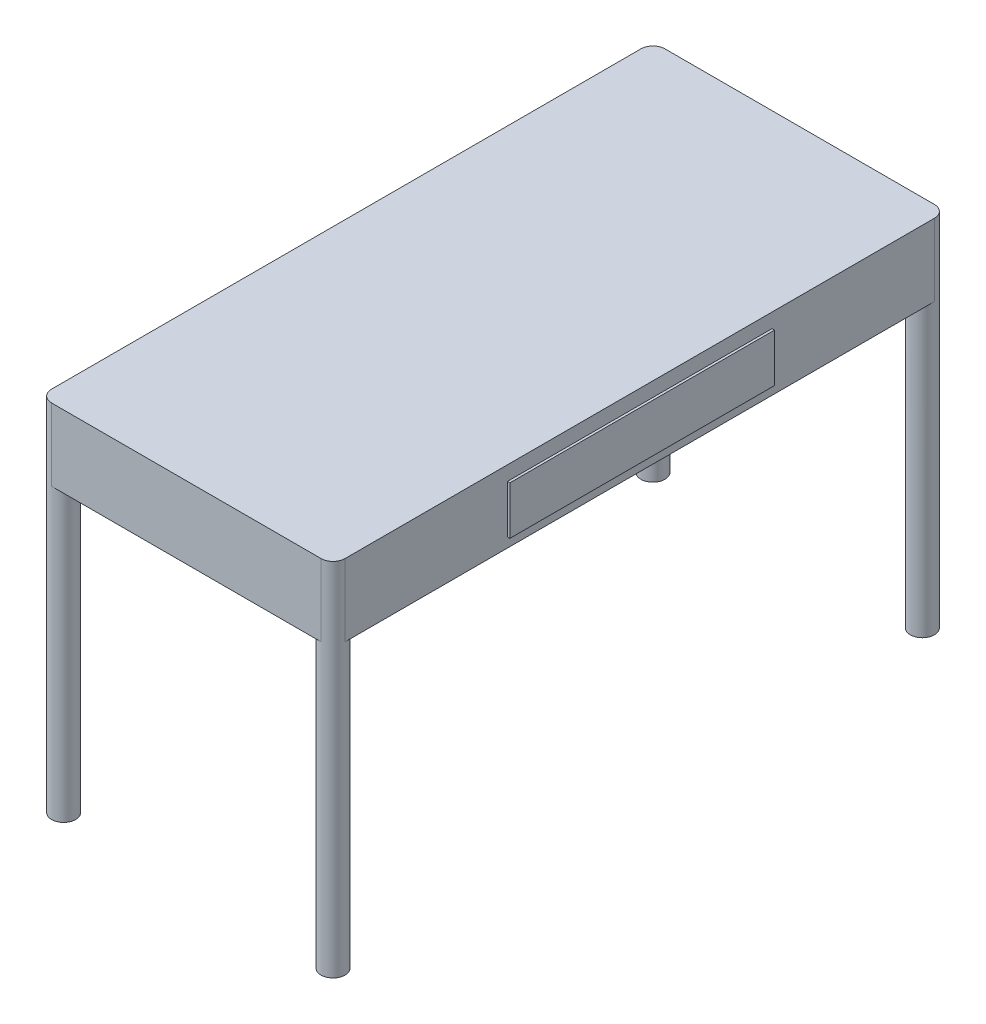
ISO-10303-21;
HEADER;
FILE_DESCRIPTION(('STEP AP214'),'2;1');
FILE_NAME('part.step','',(''),(''),'','','');
FILE_SCHEMA(('AUTOMOTIVE_DESIGN { 1 0 10303 214 1 1 1 1 }'));
ENDSEC;
DATA;
#1=APPLICATION_CONTEXT('core data for automotive mechanical design processes');
#2=APPLICATION_PROTOCOL_DEFINITION('international standard','automotive_design',2000,#1);
#3=PRODUCT_CONTEXT('',#1,'mechanical');
#4=PRODUCT('Part','Part','',(#3));
#5=PRODUCT_RELATED_PRODUCT_CATEGORY('part','',(#4));
#6=PRODUCT_DEFINITION_FORMATION('','',#4);
#7=PRODUCT_DEFINITION_CONTEXT('part definition',#1,'design');
#8=PRODUCT_DEFINITION('design','',#6,#7);
#9=PRODUCT_DEFINITION_SHAPE('','',#8);
#10=(LENGTH_UNIT() NAMED_UNIT(*) SI_UNIT(.MILLI.,.METRE.));
#11=(NAMED_UNIT(*) PLANE_ANGLE_UNIT() SI_UNIT($,.RADIAN.));
#12=(NAMED_UNIT(*) SI_UNIT($,.STERADIAN.) SOLID_ANGLE_UNIT());
#13=UNCERTAINTY_MEASURE_WITH_UNIT(LENGTH_MEASURE(1.E-05),#10,'distance_accuracy_value','');
#14=(GEOMETRIC_REPRESENTATION_CONTEXT(3) GLOBAL_UNCERTAINTY_ASSIGNED_CONTEXT((#13)) GLOBAL_UNIT_ASSIGNED_CONTEXT((#10,
#11,#12)) REPRESENTATION_CONTEXT('',''));
#15=CARTESIAN_POINT('',(0.,0.,0.));
#16=DIRECTION('',(0.,0.,1.));
#17=DIRECTION('',(1.,0.,0.));
#18=AXIS2_PLACEMENT_3D('',#15,#16,#17);
#19=CARTESIAN_POINT('',(305.,-150.,637.5));
#20=DIRECTION('',(1.,0.,0.));
#21=DIRECTION('',(0.,0.,-1.));
#22=AXIS2_PLACEMENT_3D('',#19,#20,#21);
#23=PLANE('',#22);
#24=DIRECTION('',(0.,0.,-1.));
#25=VECTOR('',#24,1.);
#26=CARTESIAN_POINT('',(305.,-150.,637.5));
#27=LINE('',#26,#25);
#28=CARTESIAN_POINT('',(305.,-150.,612.5));
#29=VERTEX_POINT('',#28);
#30=CARTESIAN_POINT('',(305.,-150.,-612.5));
#31=VERTEX_POINT('',#30);
#32=EDGE_CURVE('E175',#29,#31,#27,.T.);
#33=ORIENTED_EDGE('',*,*,#32,.T.);
#34=DIRECTION('',(0.,1.,0.));
#35=VECTOR('',#34,1.);
#36=CARTESIAN_POINT('',(305.,-150.,-612.5));
#37=LINE('',#36,#35);
#38=CARTESIAN_POINT('',(305.,0.,-612.5));
#39=VERTEX_POINT('',#38);
#40=EDGE_CURVE('E218',#31,#39,#37,.T.);
#41=ORIENTED_EDGE('',*,*,#40,.T.);
#42=DIRECTION('',(0.,0.,-1.));
#43=VECTOR('',#42,1.);
#44=CARTESIAN_POINT('',(305.,0.,637.5));
#45=LINE('',#44,#43);
#46=CARTESIAN_POINT('',(305.,0.,612.5));
#47=VERTEX_POINT('',#46);
#48=EDGE_CURVE('E174',#47,#39,#45,.T.);
#49=ORIENTED_EDGE('',*,*,#48,.F.);
#50=DIRECTION('',(0.,1.,0.));
#51=VECTOR('',#50,1.);
#52=CARTESIAN_POINT('',(305.,-150.,612.5));
#53=LINE('',#52,#51);
#54=EDGE_CURVE('E215',#47,#29,#53,.F.);
#55=ORIENTED_EDGE('',*,*,#54,.T.);
#56=EDGE_LOOP('',(#33,#41,#49,#55));
#57=FACE_BOUND('',#56,.T.);
#58=DIRECTION('',(0.,0.,1.));
#59=VECTOR('',#58,1.);
#60=CARTESIAN_POINT('',(305.,-30.,275.));
#61=LINE('',#60,#59);
#62=CARTESIAN_POINT('',(305.,-30.,-275.));
#63=VERTEX_POINT('',#62);
#64=CARTESIAN_POINT('',(305.,-30.,275.));
#65=VERTEX_POINT('',#64);
#66=EDGE_CURVE('E412',#63,#65,#61,.T.);
#67=ORIENTED_EDGE('',*,*,#66,.F.);
#68=DIRECTION('',(0.,1.,0.));
#69=VECTOR('',#68,1.);
#70=CARTESIAN_POINT('',(305.,-130.,-275.));
#71=LINE('',#70,#69);
#72=CARTESIAN_POINT('',(305.,-130.,-275.));
#73=VERTEX_POINT('',#72);
#74=EDGE_CURVE('E147',#73,#63,#71,.T.);
#75=ORIENTED_EDGE('',*,*,#74,.F.);
#76=DIRECTION('',(0.,0.,-1.));
#77=VECTOR('',#76,1.);
#78=CARTESIAN_POINT('',(305.,-130.,275.));
#79=LINE('',#78,#77);
#80=CARTESIAN_POINT('',(305.,-130.,275.));
#81=VERTEX_POINT('',#80);
#82=EDGE_CURVE('E143',#81,#73,#79,.T.);
#83=ORIENTED_EDGE('',*,*,#82,.F.);
#84=DIRECTION('',(0.,-1.,0.));
#85=VECTOR('',#84,1.);
#86=CARTESIAN_POINT('',(305.,-130.,275.));
#87=LINE('',#86,#85);
#88=EDGE_CURVE('E409',#65,#81,#87,.T.);
#89=ORIENTED_EDGE('',*,*,#88,.F.);
#90=EDGE_LOOP('',(#67,#75,#83,#89));
#91=FACE_BOUND('',#90,.T.);
#92=ADVANCED_FACE('F34',(#57,#91),#23,.T.);
#93=CARTESIAN_POINT('',(0.,-150.,0.));
#94=DIRECTION('',(0.,-1.,0.));
#95=DIRECTION('',(0.,0.,-1.));
#96=AXIS2_PLACEMENT_3D('',#93,#94,#95);
#97=PLANE('',#96);
#98=CARTESIAN_POINT('',(-280.,-150.,-612.5));
#99=DIRECTION('',(0.,-1.,0.));
#100=DIRECTION('',(0.,0.,-1.));
#101=AXIS2_PLACEMENT_3D('',#98,#99,#100);
#102=CIRCLE('',#101,25.);
#103=CARTESIAN_POINT('',(-280.,-150.,-637.5));
#104=VERTEX_POINT('',#103);
#105=CARTESIAN_POINT('',(-305.,-150.,-612.5));
#106=VERTEX_POINT('',#105);
#107=EDGE_CURVE('E152',#104,#106,#102,.T.);
#108=ORIENTED_EDGE('',*,*,#107,.F.);
#109=DIRECTION('',(-1.,0.,0.));
#110=VECTOR('',#109,1.);
#111=CARTESIAN_POINT('',(-305.,-150.,-637.5));
#112=LINE('',#111,#110);
#113=CARTESIAN_POINT('',(280.,-150.,-637.5));
#114=VERTEX_POINT('',#113);
#115=EDGE_CURVE('E178',#114,#104,#112,.T.);
#116=ORIENTED_EDGE('',*,*,#115,.F.);
#117=CARTESIAN_POINT('',(280.,-150.,-612.5));
#118=DIRECTION('',(0.,-1.,0.));
#119=DIRECTION('',(0.,0.,-1.));
#120=AXIS2_PLACEMENT_3D('',#117,#118,#119);
#121=CIRCLE('',#120,25.);
#122=EDGE_CURVE('E162',#114,#31,#121,.F.);
#123=ORIENTED_EDGE('',*,*,#122,.T.);
#124=ORIENTED_EDGE('',*,*,#32,.F.);
#125=CARTESIAN_POINT('',(280.,-150.,612.5));
#126=DIRECTION('',(0.,-1.,0.));
#127=DIRECTION('',(0.,0.,-1.));
#128=AXIS2_PLACEMENT_3D('',#125,#126,#127);
#129=CIRCLE('',#128,25.);
#130=CARTESIAN_POINT('',(280.,-150.,637.5));
#131=VERTEX_POINT('',#130);
#132=EDGE_CURVE('E57',#131,#29,#129,.T.);
#133=ORIENTED_EDGE('',*,*,#132,.F.);
#134=DIRECTION('',(1.,0.,0.));
#135=VECTOR('',#134,1.);
#136=CARTESIAN_POINT('',(-305.,-150.,637.5));
#137=LINE('',#136,#135);
#138=CARTESIAN_POINT('',(-280.,-150.,637.5));
#139=VERTEX_POINT('',#138);
#140=EDGE_CURVE('E185',#139,#131,#137,.T.);
#141=ORIENTED_EDGE('',*,*,#140,.F.);
#142=CARTESIAN_POINT('',(-280.,-150.,612.5));
#143=DIRECTION('',(0.,-1.,0.));
#144=DIRECTION('',(0.,0.,-1.));
#145=AXIS2_PLACEMENT_3D('',#142,#143,#144);
#146=CIRCLE('',#145,25.);
#147=CARTESIAN_POINT('',(-305.,-150.,612.5));
#148=VERTEX_POINT('',#147);
#149=EDGE_CURVE('E168',#139,#148,#146,.F.);
#150=ORIENTED_EDGE('',*,*,#149,.T.);
#151=DIRECTION('',(0.,0.,1.));
#152=VECTOR('',#151,1.);
#153=CARTESIAN_POINT('',(-305.,-150.,637.5));
#154=LINE('',#153,#152);
#155=EDGE_CURVE('E182',#106,#148,#154,.T.);
#156=ORIENTED_EDGE('',*,*,#155,.F.);
#157=EDGE_LOOP('',(#108,#116,#123,#124,#133,#141,#150,#156));
#158=FACE_BOUND('',#157,.T.);
#159=ADVANCED_FACE('F240',(#158),#97,.T.);
#160=CARTESIAN_POINT('',(-305.,-150.,637.5));
#161=DIRECTION('',(0.,0.,1.));
#162=DIRECTION('',(1.,0.,0.));
#163=AXIS2_PLACEMENT_3D('',#160,#161,#162);
#164=PLANE('',#163);
#165=DIRECTION('',(1.,0.,0.));
#166=VECTOR('',#165,1.);
#167=CARTESIAN_POINT('',(-305.,0.,637.5));
#168=LINE('',#167,#166);
#169=CARTESIAN_POINT('',(-280.,0.,637.5));
#170=VERTEX_POINT('',#169);
#171=CARTESIAN_POINT('',(280.,0.,637.5));
#172=VERTEX_POINT('',#171);
#173=EDGE_CURVE('E179',#170,#172,#168,.T.);
#174=ORIENTED_EDGE('',*,*,#173,.F.);
#175=DIRECTION('',(0.,1.,0.));
#176=VECTOR('',#175,1.);
#177=CARTESIAN_POINT('',(-280.,-150.,637.5));
#178=LINE('',#177,#176);
#179=EDGE_CURVE('E11',#170,#139,#178,.F.);
#180=ORIENTED_EDGE('',*,*,#179,.T.);
#181=ORIENTED_EDGE('',*,*,#140,.T.);
#182=DIRECTION('',(0.,1.,0.));
#183=VECTOR('',#182,1.);
#184=CARTESIAN_POINT('',(280.,-150.,637.5));
#185=LINE('',#184,#183);
#186=EDGE_CURVE('E42',#131,#172,#185,.T.);
#187=ORIENTED_EDGE('',*,*,#186,.T.);
#188=EDGE_LOOP('',(#174,#180,#181,#187));
#189=FACE_BOUND('',#188,.T.);
#190=ADVANCED_FACE('F224',(#189),#164,.T.);
#191=CARTESIAN_POINT('',(-305.,-150.,637.5));
#192=DIRECTION('',(-1.,0.,0.));
#193=DIRECTION('',(0.,0.,1.));
#194=AXIS2_PLACEMENT_3D('',#191,#192,#193);
#195=PLANE('',#194);
#196=DIRECTION('',(0.,0.,1.));
#197=VECTOR('',#196,1.);
#198=CARTESIAN_POINT('',(-305.,0.,637.5));
#199=LINE('',#198,#197);
#200=CARTESIAN_POINT('',(-305.,0.,-612.5));
#201=VERTEX_POINT('',#200);
#202=CARTESIAN_POINT('',(-305.,0.,612.5));
#203=VERTEX_POINT('',#202);
#204=EDGE_CURVE('E193',#201,#203,#199,.T.);
#205=ORIENTED_EDGE('',*,*,#204,.F.);
#206=DIRECTION('',(0.,1.,0.));
#207=VECTOR('',#206,1.);
#208=CARTESIAN_POINT('',(-305.,-150.,-612.5));
#209=LINE('',#208,#207);
#210=EDGE_CURVE('E213',#201,#106,#209,.F.);
#211=ORIENTED_EDGE('',*,*,#210,.T.);
#212=ORIENTED_EDGE('',*,*,#155,.T.);
#213=DIRECTION('',(0.,1.,0.));
#214=VECTOR('',#213,1.);
#215=CARTESIAN_POINT('',(-305.,-150.,612.5));
#216=LINE('',#215,#214);
#217=EDGE_CURVE('E210',#148,#203,#216,.T.);
#218=ORIENTED_EDGE('',*,*,#217,.T.);
#219=EDGE_LOOP('',(#205,#211,#212,#218));
#220=FACE_BOUND('',#219,.T.);
#221=ADVANCED_FACE('F236',(#220),#195,.T.);
#222=CARTESIAN_POINT('',(-305.,-150.,-637.5));
#223=DIRECTION('',(0.,0.,-1.));
#224=DIRECTION('',(-1.,0.,0.));
#225=AXIS2_PLACEMENT_3D('',#222,#223,#224);
#226=PLANE('',#225);
#227=ORIENTED_EDGE('',*,*,#115,.T.);
#228=DIRECTION('',(0.,1.,0.));
#229=VECTOR('',#228,1.);
#230=CARTESIAN_POINT('',(-280.,-150.,-637.5));
#231=LINE('',#230,#229);
#232=CARTESIAN_POINT('',(-280.,0.,-637.5));
#233=VERTEX_POINT('',#232);
#234=EDGE_CURVE('E199',#104,#233,#231,.T.);
#235=ORIENTED_EDGE('',*,*,#234,.T.);
#236=DIRECTION('',(-1.,0.,0.));
#237=VECTOR('',#236,1.);
#238=CARTESIAN_POINT('',(-305.,0.,-637.5));
#239=LINE('',#238,#237);
#240=CARTESIAN_POINT('',(280.,0.,-637.5));
#241=VERTEX_POINT('',#240);
#242=EDGE_CURVE('E190',#241,#233,#239,.T.);
#243=ORIENTED_EDGE('',*,*,#242,.F.);
#244=DIRECTION('',(0.,1.,0.));
#245=VECTOR('',#244,1.);
#246=CARTESIAN_POINT('',(280.,-150.,-637.5));
#247=LINE('',#246,#245);
#248=EDGE_CURVE('E187',#241,#114,#247,.F.);
#249=ORIENTED_EDGE('',*,*,#248,.T.);
#250=EDGE_LOOP('',(#227,#235,#243,#249));
#251=FACE_BOUND('',#250,.T.);
#252=ADVANCED_FACE('F247',(#251),#226,.T.);
#253=CARTESIAN_POINT('',(0.,0.,0.));
#254=DIRECTION('',(0.,-1.,0.));
#255=DIRECTION('',(0.,0.,-1.));
#256=AXIS2_PLACEMENT_3D('',#253,#254,#255);
#257=PLANE('',#256);
#258=ORIENTED_EDGE('',*,*,#242,.T.);
#259=CARTESIAN_POINT('',(-280.,0.,-612.5));
#260=DIRECTION('',(0.,-1.,0.));
#261=DIRECTION('',(0.,0.,-1.));
#262=AXIS2_PLACEMENT_3D('',#259,#260,#261);
#263=CIRCLE('',#262,25.);
#264=EDGE_CURVE('E208',#233,#201,#263,.F.);
#265=ORIENTED_EDGE('',*,*,#264,.T.);
#266=ORIENTED_EDGE('',*,*,#204,.T.);
#267=CARTESIAN_POINT('',(-280.,0.,612.5));
#268=DIRECTION('',(0.,-1.,0.));
#269=DIRECTION('',(0.,0.,-1.));
#270=AXIS2_PLACEMENT_3D('',#267,#268,#269);
#271=CIRCLE('',#270,25.);
#272=EDGE_CURVE('E204',#203,#170,#271,.F.);
#273=ORIENTED_EDGE('',*,*,#272,.T.);
#274=ORIENTED_EDGE('',*,*,#173,.T.);
#275=CARTESIAN_POINT('',(280.,0.,612.5));
#276=DIRECTION('',(0.,-1.,0.));
#277=DIRECTION('',(0.,0.,-1.));
#278=AXIS2_PLACEMENT_3D('',#275,#276,#277);
#279=CIRCLE('',#278,25.);
#280=EDGE_CURVE('E202',#172,#47,#279,.F.);
#281=ORIENTED_EDGE('',*,*,#280,.T.);
#282=ORIENTED_EDGE('',*,*,#48,.T.);
#283=CARTESIAN_POINT('',(280.,0.,-612.5));
#284=DIRECTION('',(0.,-1.,0.));
#285=DIRECTION('',(0.,0.,-1.));
#286=AXIS2_PLACEMENT_3D('',#283,#284,#285);
#287=CIRCLE('',#286,25.);
#288=EDGE_CURVE('E206',#39,#241,#287,.F.);
#289=ORIENTED_EDGE('',*,*,#288,.T.);
#290=EDGE_LOOP('',(#258,#265,#266,#273,#274,#281,#282,#289));
#291=FACE_BOUND('',#290,.T.);
#292=ADVANCED_FACE('F228',(#291),#257,.F.);
#293=CARTESIAN_POINT('',(-280.,-150.,-612.5));
#294=DIRECTION('',(0.,1.,0.));
#295=DIRECTION('',(0.,0.,1.));
#296=AXIS2_PLACEMENT_3D('',#293,#294,#295);
#297=CYLINDRICAL_SURFACE('',#296,25.);
#298=ORIENTED_EDGE('',*,*,#234,.F.);
#299=ORIENTED_EDGE('',*,*,#107,.T.);
#300=ORIENTED_EDGE('',*,*,#210,.F.);
#301=ORIENTED_EDGE('',*,*,#264,.F.);
#302=EDGE_LOOP('',(#298,#299,#300,#301));
#303=FACE_BOUND('',#302,.T.);
#304=CARTESIAN_POINT('',(-280.,-750.,-612.5));
#305=DIRECTION('',(0.,1.,0.));
#306=DIRECTION('',(0.,0.,-1.));
#307=AXIS2_PLACEMENT_3D('',#304,#305,#306);
#308=CIRCLE('',#307,25.);
#309=CARTESIAN_POINT('',(-280.,-750.,-637.5));
#310=VERTEX_POINT('',#309);
#311=EDGE_CURVE('E149',#310,#310,#308,.T.);
#312=ORIENTED_EDGE('',*,*,#311,.T.);
#313=EDGE_LOOP('',(#312));
#314=FACE_BOUND('',#313,.T.);
#315=ADVANCED_FACE('F243',(#303,#314),#297,.T.);
#316=CARTESIAN_POINT('',(280.,-150.,-612.5));
#317=DIRECTION('',(0.,1.,0.));
#318=DIRECTION('',(0.,0.,1.));
#319=AXIS2_PLACEMENT_3D('',#316,#317,#318);
#320=CYLINDRICAL_SURFACE('',#319,25.);
#321=ORIENTED_EDGE('',*,*,#40,.F.);
#322=ORIENTED_EDGE('',*,*,#122,.F.);
#323=ORIENTED_EDGE('',*,*,#248,.F.);
#324=ORIENTED_EDGE('',*,*,#288,.F.);
#325=EDGE_LOOP('',(#321,#322,#323,#324));
#326=FACE_BOUND('',#325,.T.);
#327=CARTESIAN_POINT('',(280.,-750.,-612.5));
#328=DIRECTION('',(0.,-1.,0.));
#329=DIRECTION('',(0.,0.,-1.));
#330=AXIS2_PLACEMENT_3D('',#327,#328,#329);
#331=CIRCLE('',#330,25.);
#332=CARTESIAN_POINT('',(280.,-750.,-637.5));
#333=VERTEX_POINT('',#332);
#334=EDGE_CURVE('E159',#333,#333,#331,.T.);
#335=ORIENTED_EDGE('',*,*,#334,.F.);
#336=EDGE_LOOP('',(#335));
#337=FACE_BOUND('',#336,.T.);
#338=ADVANCED_FACE('F251',(#326,#337),#320,.T.);
#339=CARTESIAN_POINT('',(-280.,-150.,612.5));
#340=DIRECTION('',(0.,1.,0.));
#341=DIRECTION('',(0.,0.,1.));
#342=AXIS2_PLACEMENT_3D('',#339,#340,#341);
#343=CYLINDRICAL_SURFACE('',#342,25.);
#344=ORIENTED_EDGE('',*,*,#217,.F.);
#345=ORIENTED_EDGE('',*,*,#149,.F.);
#346=ORIENTED_EDGE('',*,*,#179,.F.);
#347=ORIENTED_EDGE('',*,*,#272,.F.);
#348=EDGE_LOOP('',(#344,#345,#346,#347));
#349=FACE_BOUND('',#348,.T.);
#350=CARTESIAN_POINT('',(-280.,-750.,612.5));
#351=DIRECTION('',(0.,-1.,0.));
#352=DIRECTION('',(0.,0.,1.));
#353=AXIS2_PLACEMENT_3D('',#350,#351,#352);
#354=CIRCLE('',#353,25.);
#355=CARTESIAN_POINT('',(-280.,-750.,637.5));
#356=VERTEX_POINT('',#355);
#357=EDGE_CURVE('E165',#356,#356,#354,.T.);
#358=ORIENTED_EDGE('',*,*,#357,.F.);
#359=EDGE_LOOP('',(#358));
#360=FACE_BOUND('',#359,.T.);
#361=ADVANCED_FACE('F233',(#349,#360),#343,.T.);
#362=CARTESIAN_POINT('',(280.,-150.,612.5));
#363=DIRECTION('',(0.,1.,0.));
#364=DIRECTION('',(0.,0.,1.));
#365=AXIS2_PLACEMENT_3D('',#362,#363,#364);
#366=CYLINDRICAL_SURFACE('',#365,25.);
#367=ORIENTED_EDGE('',*,*,#186,.F.);
#368=ORIENTED_EDGE('',*,*,#132,.T.);
#369=ORIENTED_EDGE('',*,*,#54,.F.);
#370=ORIENTED_EDGE('',*,*,#280,.F.);
#371=EDGE_LOOP('',(#367,#368,#369,#370));
#372=FACE_BOUND('',#371,.T.);
#373=CARTESIAN_POINT('',(280.,-750.,612.5));
#374=DIRECTION('',(0.,1.,0.));
#375=DIRECTION('',(0.,0.,1.));
#376=AXIS2_PLACEMENT_3D('',#373,#374,#375);
#377=CIRCLE('',#376,25.);
#378=CARTESIAN_POINT('',(280.,-750.,637.5));
#379=VERTEX_POINT('',#378);
#380=EDGE_CURVE('E170',#379,#379,#377,.T.);
#381=ORIENTED_EDGE('',*,*,#380,.T.);
#382=EDGE_LOOP('',(#381));
#383=FACE_BOUND('',#382,.T.);
#384=ADVANCED_FACE('F36',(#372,#383),#366,.T.);
#385=CARTESIAN_POINT('',(280.,-750.,612.5));
#386=DIRECTION('',(0.,1.,0.));
#387=DIRECTION('',(0.,0.,1.));
#388=AXIS2_PLACEMENT_3D('',#385,#386,#387);
#389=PLANE('',#388);
#390=ORIENTED_EDGE('',*,*,#380,.F.);
#391=EDGE_LOOP('',(#390));
#392=FACE_BOUND('',#391,.T.);
#393=ADVANCED_FACE('F258',(#392),#389,.F.);
#394=CARTESIAN_POINT('',(-280.,-750.,612.5));
#395=DIRECTION('',(0.,1.,0.));
#396=DIRECTION('',(0.,0.,1.));
#397=AXIS2_PLACEMENT_3D('',#394,#395,#396);
#398=PLANE('',#397);
#399=ORIENTED_EDGE('',*,*,#357,.T.);
#400=EDGE_LOOP('',(#399));
#401=FACE_BOUND('',#400,.T.);
#402=ADVANCED_FACE('F262',(#401),#398,.F.);
#403=CARTESIAN_POINT('',(280.,-750.,-612.5));
#404=DIRECTION('',(0.,1.,0.));
#405=DIRECTION('',(0.,0.,-1.));
#406=AXIS2_PLACEMENT_3D('',#403,#404,#405);
#407=PLANE('',#406);
#408=ORIENTED_EDGE('',*,*,#334,.T.);
#409=EDGE_LOOP('',(#408));
#410=FACE_BOUND('',#409,.T.);
#411=ADVANCED_FACE('F267',(#410),#407,.F.);
#412=CARTESIAN_POINT('',(-280.,-750.,-612.5));
#413=DIRECTION('',(0.,1.,0.));
#414=DIRECTION('',(0.,0.,-1.));
#415=AXIS2_PLACEMENT_3D('',#412,#413,#414);
#416=PLANE('',#415);
#417=ORIENTED_EDGE('',*,*,#311,.F.);
#418=EDGE_LOOP('',(#417));
#419=FACE_BOUND('',#418,.T.);
#420=ADVANCED_FACE('F346',(#419),#416,.F.);
#421=CARTESIAN_POINT('',(310.,-130.,-275.));
#422=DIRECTION('',(0.,0.,1.));
#423=DIRECTION('',(1.,0.,0.));
#424=AXIS2_PLACEMENT_3D('',#421,#422,#423);
#425=PLANE('',#424);
#426=ORIENTED_EDGE('',*,*,#74,.T.);
#427=DIRECTION('',(-1.,0.,0.));
#428=VECTOR('',#427,1.);
#429=CARTESIAN_POINT('',(310.,-30.,-275.));
#430=LINE('',#429,#428);
#431=CARTESIAN_POINT('',(310.,-30.,-275.));
#432=VERTEX_POINT('',#431);
#433=EDGE_CURVE('E128',#432,#63,#430,.T.);
#434=ORIENTED_EDGE('',*,*,#433,.F.);
#435=DIRECTION('',(0.,1.,0.));
#436=VECTOR('',#435,1.);
#437=CARTESIAN_POINT('',(310.,-130.,-275.));
#438=LINE('',#437,#436);
#439=CARTESIAN_POINT('',(310.,-130.,-275.));
#440=VERTEX_POINT('',#439);
#441=EDGE_CURVE('E135',#440,#432,#438,.T.);
#442=ORIENTED_EDGE('',*,*,#441,.F.);
#443=DIRECTION('',(-1.,0.,0.));
#444=VECTOR('',#443,1.);
#445=CARTESIAN_POINT('',(310.,-130.,-275.));
#446=LINE('',#445,#444);
#447=EDGE_CURVE('E407',#440,#73,#446,.T.);
#448=ORIENTED_EDGE('',*,*,#447,.T.);
#449=EDGE_LOOP('',(#426,#434,#442,#448));
#450=FACE_BOUND('',#449,.T.);
#451=ADVANCED_FACE('F145',(#450),#425,.F.);
#452=CARTESIAN_POINT('',(310.,-30.,275.));
#453=DIRECTION('',(0.,-1.,0.));
#454=DIRECTION('',(0.,0.,-1.));
#455=AXIS2_PLACEMENT_3D('',#452,#453,#454);
#456=PLANE('',#455);
#457=ORIENTED_EDGE('',*,*,#66,.T.);
#458=DIRECTION('',(-1.,0.,0.));
#459=VECTOR('',#458,1.);
#460=CARTESIAN_POINT('',(310.,-30.,275.));
#461=LINE('',#460,#459);
#462=CARTESIAN_POINT('',(310.,-30.,275.));
#463=VERTEX_POINT('',#462);
#464=EDGE_CURVE('E131',#463,#65,#461,.T.);
#465=ORIENTED_EDGE('',*,*,#464,.F.);
#466=DIRECTION('',(0.,0.,1.));
#467=VECTOR('',#466,1.);
#468=CARTESIAN_POINT('',(310.,-30.,275.));
#469=LINE('',#468,#467);
#470=EDGE_CURVE('E124',#432,#463,#469,.T.);
#471=ORIENTED_EDGE('',*,*,#470,.F.);
#472=ORIENTED_EDGE('',*,*,#433,.T.);
#473=EDGE_LOOP('',(#457,#465,#471,#472));
#474=FACE_BOUND('',#473,.T.);
#475=ADVANCED_FACE('F126',(#474),#456,.F.);
#476=CARTESIAN_POINT('',(310.,-130.,275.));
#477=DIRECTION('',(0.,0.,-1.));
#478=DIRECTION('',(0.,1.,0.));
#479=AXIS2_PLACEMENT_3D('',#476,#477,#478);
#480=PLANE('',#479);
#481=ORIENTED_EDGE('',*,*,#88,.T.);
#482=DIRECTION('',(-1.,0.,0.));
#483=VECTOR('',#482,1.);
#484=CARTESIAN_POINT('',(310.,-130.,275.));
#485=LINE('',#484,#483);
#486=CARTESIAN_POINT('',(310.,-130.,275.));
#487=VERTEX_POINT('',#486);
#488=EDGE_CURVE('E49',#487,#81,#485,.T.);
#489=ORIENTED_EDGE('',*,*,#488,.F.);
#490=DIRECTION('',(0.,-1.,0.));
#491=VECTOR('',#490,1.);
#492=CARTESIAN_POINT('',(310.,-130.,275.));
#493=LINE('',#492,#491);
#494=EDGE_CURVE('E134',#463,#487,#493,.T.);
#495=ORIENTED_EDGE('',*,*,#494,.F.);
#496=ORIENTED_EDGE('',*,*,#464,.T.);
#497=EDGE_LOOP('',(#481,#489,#495,#496));
#498=FACE_BOUND('',#497,.T.);
#499=ADVANCED_FACE('F376',(#498),#480,.F.);
#500=CARTESIAN_POINT('',(310.,-130.,275.));
#501=DIRECTION('',(0.,1.,0.));
#502=DIRECTION('',(0.,0.,1.));
#503=AXIS2_PLACEMENT_3D('',#500,#501,#502);
#504=PLANE('',#503);
#505=ORIENTED_EDGE('',*,*,#82,.T.);
#506=ORIENTED_EDGE('',*,*,#447,.F.);
#507=DIRECTION('',(0.,0.,-1.));
#508=VECTOR('',#507,1.);
#509=CARTESIAN_POINT('',(310.,-130.,275.));
#510=LINE('',#509,#508);
#511=EDGE_CURVE('E139',#487,#440,#510,.T.);
#512=ORIENTED_EDGE('',*,*,#511,.F.);
#513=ORIENTED_EDGE('',*,*,#488,.T.);
#514=EDGE_LOOP('',(#505,#506,#512,#513));
#515=FACE_BOUND('',#514,.T.);
#516=ADVANCED_FACE('F385',(#515),#504,.F.);
#517=CARTESIAN_POINT('',(310.,0.,0.));
#518=DIRECTION('',(-1.,0.,0.));
#519=DIRECTION('',(0.,0.,1.));
#520=AXIS2_PLACEMENT_3D('',#517,#518,#519);
#521=PLANE('',#520);
#522=ORIENTED_EDGE('',*,*,#441,.T.);
#523=ORIENTED_EDGE('',*,*,#470,.T.);
#524=ORIENTED_EDGE('',*,*,#494,.T.);
#525=ORIENTED_EDGE('',*,*,#511,.T.);
#526=EDGE_LOOP('',(#522,#523,#524,#525));
#527=FACE_BOUND('',#526,.T.);
#528=ADVANCED_FACE('F138',(#527),#521,.F.);
#529=CLOSED_SHELL('',(#92,#159,#190,#221,#252,#292,#315,#338,#361,#384,#393,#402,#411,#420,#451,
#475,#499,#516,#528));
#530=MANIFOLD_SOLID_BREP('B2',#529);
#531=ADVANCED_BREP_SHAPE_REPRESENTATION('',(#18,#530),#14);
#532=SHAPE_DEFINITION_REPRESENTATION(#9,#531);
ENDSEC;
END-ISO-10303-21;
